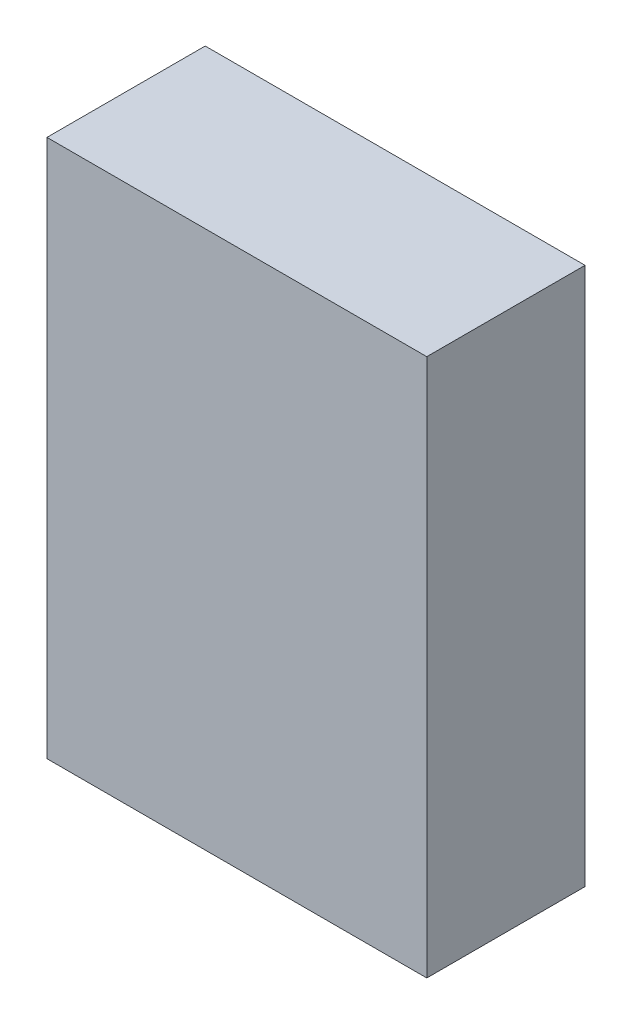
ISO-10303-21;
HEADER;
FILE_DESCRIPTION(('STEP AP214'),'2;1');
FILE_NAME('part.step','',(''),(''),'','','');
FILE_SCHEMA(('AUTOMOTIVE_DESIGN { 1 0 10303 214 1 1 1 1 }'));
ENDSEC;
DATA;
#1=APPLICATION_CONTEXT('core data for automotive mechanical design processes');
#2=APPLICATION_PROTOCOL_DEFINITION('international standard','automotive_design',2000,#1);
#3=PRODUCT_CONTEXT('',#1,'mechanical');
#4=PRODUCT('Part','Part','',(#3));
#5=PRODUCT_RELATED_PRODUCT_CATEGORY('part','',(#4));
#6=PRODUCT_DEFINITION_FORMATION('','',#4);
#7=PRODUCT_DEFINITION_CONTEXT('part definition',#1,'design');
#8=PRODUCT_DEFINITION('design','',#6,#7);
#9=PRODUCT_DEFINITION_SHAPE('','',#8);
#10=(LENGTH_UNIT() NAMED_UNIT(*) SI_UNIT(.MILLI.,.METRE.));
#11=(NAMED_UNIT(*) PLANE_ANGLE_UNIT() SI_UNIT($,.RADIAN.));
#12=(NAMED_UNIT(*) SI_UNIT($,.STERADIAN.) SOLID_ANGLE_UNIT());
#13=UNCERTAINTY_MEASURE_WITH_UNIT(LENGTH_MEASURE(1.E-05),#10,'distance_accuracy_value','');
#14=(GEOMETRIC_REPRESENTATION_CONTEXT(3) GLOBAL_UNCERTAINTY_ASSIGNED_CONTEXT((#13)) GLOBAL_UNIT_ASSIGNED_CONTEXT((#10,
#11,#12)) REPRESENTATION_CONTEXT('',''));
#15=CARTESIAN_POINT('',(0.,0.,0.));
#16=DIRECTION('',(0.,0.,1.));
#17=DIRECTION('',(1.,0.,0.));
#18=AXIS2_PLACEMENT_3D('',#15,#16,#17);
#19=CARTESIAN_POINT('',(0.63,-2.92,0.));
#20=DIRECTION('',(1.,0.,0.));
#21=DIRECTION('',(0.,0.,1.));
#22=AXIS2_PLACEMENT_3D('',#19,#20,#21);
#23=PLANE('',#22);
#24=DIRECTION('',(0.,1.,0.));
#25=VECTOR('',#24,1.);
#26=CARTESIAN_POINT('',(0.63,-2.92,0.1));
#27=LINE('',#26,#25);
#28=CARTESIAN_POINT('',(0.63,-2.92,0.1));
#29=VERTEX_POINT('',#28);
#30=CARTESIAN_POINT('',(0.63,-2.58,0.1));
#31=VERTEX_POINT('',#30);
#32=EDGE_CURVE('E11',#29,#31,#27,.T.);
#33=ORIENTED_EDGE('',*,*,#32,.T.);
#34=DIRECTION('',(0.,0.,1.));
#35=VECTOR('',#34,1.);
#36=CARTESIAN_POINT('',(0.63,-2.58,0.));
#37=LINE('',#36,#35);
#38=CARTESIAN_POINT('',(0.63,-2.58,0.));
#39=VERTEX_POINT('',#38);
#40=EDGE_CURVE('E24',#39,#31,#37,.T.);
#41=ORIENTED_EDGE('',*,*,#40,.F.);
#42=DIRECTION('',(0.,1.,0.));
#43=VECTOR('',#42,1.);
#44=CARTESIAN_POINT('',(0.63,-2.92,0.));
#45=LINE('',#44,#43);
#46=CARTESIAN_POINT('',(0.63,-2.92,0.));
#47=VERTEX_POINT('',#46);
#48=EDGE_CURVE('E86',#47,#39,#45,.T.);
#49=ORIENTED_EDGE('',*,*,#48,.F.);
#50=DIRECTION('',(0.,0.,1.));
#51=VECTOR('',#50,1.);
#52=CARTESIAN_POINT('',(0.63,-2.92,0.));
#53=LINE('',#52,#51);
#54=EDGE_CURVE('E36',#47,#29,#53,.T.);
#55=ORIENTED_EDGE('',*,*,#54,.T.);
#56=EDGE_LOOP('',(#33,#41,#49,#55));
#57=FACE_BOUND('',#56,.T.);
#58=ADVANCED_FACE('F17',(#57),#23,.F.);
#59=CARTESIAN_POINT('',(0.87,-2.92,0.));
#60=DIRECTION('',(1.,0.,0.));
#61=DIRECTION('',(0.,0.,1.));
#62=AXIS2_PLACEMENT_3D('',#59,#60,#61);
#63=PLANE('',#62);
#64=DIRECTION('',(0.,0.,1.));
#65=VECTOR('',#64,1.);
#66=CARTESIAN_POINT('',(0.87,-2.92,0.));
#67=LINE('',#66,#65);
#68=CARTESIAN_POINT('',(0.87,-2.92,0.));
#69=VERTEX_POINT('',#68);
#70=CARTESIAN_POINT('',(0.87,-2.92,0.1));
#71=VERTEX_POINT('',#70);
#72=EDGE_CURVE('E83',#69,#71,#67,.T.);
#73=ORIENTED_EDGE('',*,*,#72,.F.);
#74=DIRECTION('',(0.,1.,0.));
#75=VECTOR('',#74,1.);
#76=CARTESIAN_POINT('',(0.87,-2.92,0.));
#77=LINE('',#76,#75);
#78=CARTESIAN_POINT('',(0.87,-2.58,0.));
#79=VERTEX_POINT('',#78);
#80=EDGE_CURVE('E63',#69,#79,#77,.T.);
#81=ORIENTED_EDGE('',*,*,#80,.T.);
#82=DIRECTION('',(0.,0.,1.));
#83=VECTOR('',#82,1.);
#84=CARTESIAN_POINT('',(0.87,-2.58,0.));
#85=LINE('',#84,#83);
#86=CARTESIAN_POINT('',(0.87,-2.58,0.1));
#87=VERTEX_POINT('',#86);
#88=EDGE_CURVE('E57',#79,#87,#85,.T.);
#89=ORIENTED_EDGE('',*,*,#88,.T.);
#90=DIRECTION('',(0.,1.,0.));
#91=VECTOR('',#90,1.);
#92=CARTESIAN_POINT('',(0.87,-2.92,0.1));
#93=LINE('',#92,#91);
#94=EDGE_CURVE('E60',#71,#87,#93,.T.);
#95=ORIENTED_EDGE('',*,*,#94,.F.);
#96=EDGE_LOOP('',(#73,#81,#89,#95));
#97=FACE_BOUND('',#96,.T.);
#98=ADVANCED_FACE('F59',(#97),#63,.T.);
#99=CARTESIAN_POINT('',(0.63,-2.92,0.));
#100=DIRECTION('',(0.,1.,0.));
#101=DIRECTION('',(0.,0.,1.));
#102=AXIS2_PLACEMENT_3D('',#99,#100,#101);
#103=PLANE('',#102);
#104=ORIENTED_EDGE('',*,*,#72,.T.);
#105=DIRECTION('',(1.,0.,0.));
#106=VECTOR('',#105,1.);
#107=CARTESIAN_POINT('',(0.63,-2.92,0.1));
#108=LINE('',#107,#106);
#109=EDGE_CURVE('E71',#29,#71,#108,.T.);
#110=ORIENTED_EDGE('',*,*,#109,.F.);
#111=ORIENTED_EDGE('',*,*,#54,.F.);
#112=DIRECTION('',(1.,0.,0.));
#113=VECTOR('',#112,1.);
#114=CARTESIAN_POINT('',(0.63,-2.92,0.));
#115=LINE('',#114,#113);
#116=EDGE_CURVE('E76',#47,#69,#115,.T.);
#117=ORIENTED_EDGE('',*,*,#116,.T.);
#118=EDGE_LOOP('',(#104,#110,#111,#117));
#119=FACE_BOUND('',#118,.T.);
#120=ADVANCED_FACE('F91',(#119),#103,.F.);
#121=CARTESIAN_POINT('',(0.63,-2.58,0.));
#122=DIRECTION('',(0.,1.,0.));
#123=DIRECTION('',(0.,0.,1.));
#124=AXIS2_PLACEMENT_3D('',#121,#122,#123);
#125=PLANE('',#124);
#126=DIRECTION('',(1.,0.,0.));
#127=VECTOR('',#126,1.);
#128=CARTESIAN_POINT('',(0.63,-2.58,0.));
#129=LINE('',#128,#127);
#130=EDGE_CURVE('E74',#39,#79,#129,.T.);
#131=ORIENTED_EDGE('',*,*,#130,.F.);
#132=ORIENTED_EDGE('',*,*,#40,.T.);
#133=DIRECTION('',(1.,0.,0.));
#134=VECTOR('',#133,1.);
#135=CARTESIAN_POINT('',(0.63,-2.58,0.1));
#136=LINE('',#135,#134);
#137=EDGE_CURVE('E69',#31,#87,#136,.T.);
#138=ORIENTED_EDGE('',*,*,#137,.T.);
#139=ORIENTED_EDGE('',*,*,#88,.F.);
#140=EDGE_LOOP('',(#131,#132,#138,#139));
#141=FACE_BOUND('',#140,.T.);
#142=ADVANCED_FACE('F73',(#141),#125,.T.);
#143=CARTESIAN_POINT('',(0.63,-2.92,0.));
#144=DIRECTION('',(0.,0.,1.));
#145=DIRECTION('',(1.,0.,0.));
#146=AXIS2_PLACEMENT_3D('',#143,#144,#145);
#147=PLANE('',#146);
#148=ORIENTED_EDGE('',*,*,#130,.T.);
#149=ORIENTED_EDGE('',*,*,#80,.F.);
#150=ORIENTED_EDGE('',*,*,#116,.F.);
#151=ORIENTED_EDGE('',*,*,#48,.T.);
#152=EDGE_LOOP('',(#148,#149,#150,#151));
#153=FACE_BOUND('',#152,.T.);
#154=ADVANCED_FACE('F89',(#153),#147,.F.);
#155=CARTESIAN_POINT('',(0.63,-2.92,0.1));
#156=DIRECTION('',(0.,0.,1.));
#157=DIRECTION('',(1.,0.,0.));
#158=AXIS2_PLACEMENT_3D('',#155,#156,#157);
#159=PLANE('',#158);
#160=ORIENTED_EDGE('',*,*,#32,.F.);
#161=ORIENTED_EDGE('',*,*,#109,.T.);
#162=ORIENTED_EDGE('',*,*,#94,.T.);
#163=ORIENTED_EDGE('',*,*,#137,.F.);
#164=EDGE_LOOP('',(#160,#161,#162,#163));
#165=FACE_BOUND('',#164,.T.);
#166=ADVANCED_FACE('F68',(#165),#159,.T.);
#167=CLOSED_SHELL('',(#58,#98,#120,#142,#154,#166));
#168=MANIFOLD_SOLID_BREP('B1',#167);
#169=ADVANCED_BREP_SHAPE_REPRESENTATION('',(#18,#168),#14);
#170=SHAPE_DEFINITION_REPRESENTATION(#9,#169);
ENDSEC;
END-ISO-10303-21;
